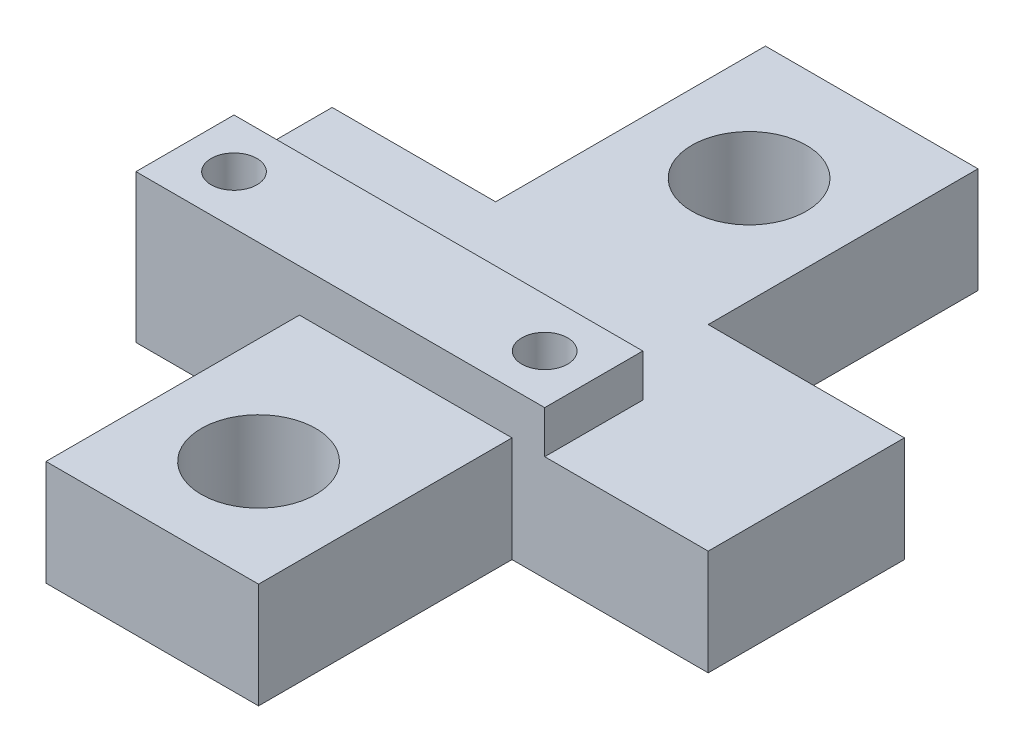
ISO-10303-21;
HEADER;
FILE_DESCRIPTION(('STEP AP214'),'2;1');
FILE_NAME('part.step','',(''),(''),'','','');
FILE_SCHEMA(('AUTOMOTIVE_DESIGN { 1 0 10303 214 1 1 1 1 }'));
ENDSEC;
DATA;
#1=APPLICATION_CONTEXT('core data for automotive mechanical design processes');
#2=APPLICATION_PROTOCOL_DEFINITION('international standard','automotive_design',2000,#1);
#3=PRODUCT_CONTEXT('',#1,'mechanical');
#4=PRODUCT('Part','Part','',(#3));
#5=PRODUCT_RELATED_PRODUCT_CATEGORY('part','',(#4));
#6=PRODUCT_DEFINITION_FORMATION('','',#4);
#7=PRODUCT_DEFINITION_CONTEXT('part definition',#1,'design');
#8=PRODUCT_DEFINITION('design','',#6,#7);
#9=PRODUCT_DEFINITION_SHAPE('','',#8);
#10=(LENGTH_UNIT() NAMED_UNIT(*) SI_UNIT(.MILLI.,.METRE.));
#11=(NAMED_UNIT(*) PLANE_ANGLE_UNIT() SI_UNIT($,.RADIAN.));
#12=(NAMED_UNIT(*) SI_UNIT($,.STERADIAN.) SOLID_ANGLE_UNIT());
#13=UNCERTAINTY_MEASURE_WITH_UNIT(LENGTH_MEASURE(1.E-05),#10,'distance_accuracy_value','');
#14=(GEOMETRIC_REPRESENTATION_CONTEXT(3) GLOBAL_UNCERTAINTY_ASSIGNED_CONTEXT((#13)) GLOBAL_UNIT_ASSIGNED_CONTEXT((#10,
#11,#12)) REPRESENTATION_CONTEXT('',''));
#15=CARTESIAN_POINT('',(0.,0.,0.));
#16=DIRECTION('',(0.,0.,1.));
#17=DIRECTION('',(1.,0.,0.));
#18=AXIS2_PLACEMENT_3D('',#15,#16,#17);
#19=CARTESIAN_POINT('',(0.,6.45,0.));
#20=DIRECTION('',(0.,1.,0.));
#21=DIRECTION('',(0.,0.,1.));
#22=AXIS2_PLACEMENT_3D('',#19,#20,#21);
#23=PLANE('',#22);
#24=CARTESIAN_POINT('',(-0.999999999999997,6.45,15.));
#25=DIRECTION('',(0.,1.,0.));
#26=DIRECTION('',(0.,0.,1.));
#27=AXIS2_PLACEMENT_3D('',#24,#25,#26);
#28=CIRCLE('',#27,3.5);
#29=CARTESIAN_POINT('',(-0.999999999999997,6.45,18.5));
#30=VERTEX_POINT('',#29);
#31=EDGE_CURVE('E340',#30,#30,#28,.T.);
#32=ORIENTED_EDGE('',*,*,#31,.F.);
#33=EDGE_LOOP('',(#32));
#34=FACE_BOUND('',#33,.T.);
#35=DIRECTION('',(1.,0.,0.));
#36=VECTOR('',#35,1.);
#37=CARTESIAN_POINT('',(-17.5,6.45,6.));
#38=LINE('',#37,#36);
#39=CARTESIAN_POINT('',(-7.5,6.45,6.));
#40=VERTEX_POINT('',#39);
#41=CARTESIAN_POINT('',(5.5,6.45,6.));
#42=VERTEX_POINT('',#41);
#43=EDGE_CURVE('E11',#40,#42,#38,.T.);
#44=ORIENTED_EDGE('',*,*,#43,.F.);
#45=DIRECTION('',(0.,0.,1.));
#46=VECTOR('',#45,1.);
#47=CARTESIAN_POINT('',(-7.5,6.45,21.5));
#48=LINE('',#47,#46);
#49=CARTESIAN_POINT('',(-7.5,6.45,21.5));
#50=VERTEX_POINT('',#49);
#51=EDGE_CURVE('E183',#40,#50,#48,.T.);
#52=ORIENTED_EDGE('',*,*,#51,.T.);
#53=DIRECTION('',(1.,0.,0.));
#54=VECTOR('',#53,1.);
#55=CARTESIAN_POINT('',(-7.5,6.45,21.5));
#56=LINE('',#55,#54);
#57=CARTESIAN_POINT('',(5.5,6.45,21.5));
#58=VERTEX_POINT('',#57);
#59=EDGE_CURVE('E185',#50,#58,#56,.T.);
#60=ORIENTED_EDGE('',*,*,#59,.T.);
#61=DIRECTION('',(0.,0.,-1.));
#62=VECTOR('',#61,1.);
#63=CARTESIAN_POINT('',(5.5,6.45,21.5));
#64=LINE('',#63,#62);
#65=EDGE_CURVE('E187',#58,#42,#64,.T.);
#66=ORIENTED_EDGE('',*,*,#65,.T.);
#67=EDGE_LOOP('',(#44,#52,#60,#66));
#68=FACE_BOUND('',#67,.T.);
#69=ADVANCED_FACE('F32',(#34,#68),#23,.T.);
#70=CARTESIAN_POINT('',(5.5,6.45,-6.00000000000003));
#71=DIRECTION('',(0.,0.,1.));
#72=DIRECTION('',(1.,0.,0.));
#73=AXIS2_PLACEMENT_3D('',#70,#71,#72);
#74=PLANE('',#73);
#75=DIRECTION('',(-1.,0.,0.));
#76=VECTOR('',#75,1.);
#77=CARTESIAN_POINT('',(5.5,0.,-6.00000000000003));
#78=LINE('',#77,#76);
#79=CARTESIAN_POINT('',(17.5,0.,-6.00000000000007));
#80=VERTEX_POINT('',#79);
#81=CARTESIAN_POINT('',(5.5,0.,-6.00000000000003));
#82=VERTEX_POINT('',#81);
#83=EDGE_CURVE('E160',#80,#82,#78,.T.);
#84=ORIENTED_EDGE('',*,*,#83,.T.);
#85=DIRECTION('',(0.,-1.,0.));
#86=VECTOR('',#85,1.);
#87=CARTESIAN_POINT('',(5.5,6.45,-6.00000000000003));
#88=LINE('',#87,#86);
#89=CARTESIAN_POINT('',(5.5,6.45,-6.00000000000003));
#90=VERTEX_POINT('',#89);
#91=EDGE_CURVE('E36',#90,#82,#88,.T.);
#92=ORIENTED_EDGE('',*,*,#91,.F.);
#93=DIRECTION('',(-1.,0.,0.));
#94=VECTOR('',#93,1.);
#95=CARTESIAN_POINT('',(5.5,6.45,-6.00000000000003));
#96=LINE('',#95,#94);
#97=CARTESIAN_POINT('',(17.5,6.45,-6.00000000000007));
#98=VERTEX_POINT('',#97);
#99=EDGE_CURVE('E169',#98,#90,#96,.T.);
#100=ORIENTED_EDGE('',*,*,#99,.F.);
#101=DIRECTION('',(0.,-1.,0.));
#102=VECTOR('',#101,1.);
#103=CARTESIAN_POINT('',(17.5,6.45,-6.00000000000007));
#104=LINE('',#103,#102);
#105=EDGE_CURVE('E192',#98,#80,#104,.T.);
#106=ORIENTED_EDGE('',*,*,#105,.T.);
#107=EDGE_LOOP('',(#84,#92,#100,#106));
#108=FACE_BOUND('',#107,.T.);
#109=ADVANCED_FACE('F34',(#108),#74,.F.);
#110=CARTESIAN_POINT('',(5.5,6.45,-6.00000000000003));
#111=DIRECTION('',(-1.,0.,0.));
#112=DIRECTION('',(0.,0.,1.));
#113=AXIS2_PLACEMENT_3D('',#110,#111,#112);
#114=PLANE('',#113);
#115=DIRECTION('',(0.,0.,-1.));
#116=VECTOR('',#115,1.);
#117=CARTESIAN_POINT('',(5.5,0.,-6.00000000000003));
#118=LINE('',#117,#116);
#119=CARTESIAN_POINT('',(5.5,0.,-22.5));
#120=VERTEX_POINT('',#119);
#121=EDGE_CURVE('E163',#82,#120,#118,.T.);
#122=ORIENTED_EDGE('',*,*,#121,.T.);
#123=DIRECTION('',(0.,-1.,0.));
#124=VECTOR('',#123,1.);
#125=CARTESIAN_POINT('',(5.5,6.45,-22.5));
#126=LINE('',#125,#124);
#127=CARTESIAN_POINT('',(5.5,6.45,-22.5));
#128=VERTEX_POINT('',#127);
#129=EDGE_CURVE('E242',#128,#120,#126,.T.);
#130=ORIENTED_EDGE('',*,*,#129,.F.);
#131=DIRECTION('',(0.,0.,-1.));
#132=VECTOR('',#131,1.);
#133=CARTESIAN_POINT('',(5.5,6.45,-6.00000000000003));
#134=LINE('',#133,#132);
#135=EDGE_CURVE('E172',#90,#128,#134,.T.);
#136=ORIENTED_EDGE('',*,*,#135,.F.);
#137=ORIENTED_EDGE('',*,*,#91,.T.);
#138=EDGE_LOOP('',(#122,#130,#136,#137));
#139=FACE_BOUND('',#138,.T.);
#140=ADVANCED_FACE('F251',(#139),#114,.F.);
#141=CARTESIAN_POINT('',(-7.5,6.45,-22.5));
#142=DIRECTION('',(0.,0.,1.));
#143=DIRECTION('',(1.,0.,0.));
#144=AXIS2_PLACEMENT_3D('',#141,#142,#143);
#145=PLANE('',#144);
#146=DIRECTION('',(-1.,0.,0.));
#147=VECTOR('',#146,1.);
#148=CARTESIAN_POINT('',(-7.5,0.,-22.5));
#149=LINE('',#148,#147);
#150=CARTESIAN_POINT('',(-7.5,0.,-22.5));
#151=VERTEX_POINT('',#150);
#152=EDGE_CURVE('E195',#120,#151,#149,.T.);
#153=ORIENTED_EDGE('',*,*,#152,.T.);
#154=DIRECTION('',(0.,-1.,0.));
#155=VECTOR('',#154,1.);
#156=CARTESIAN_POINT('',(-7.5,6.45,-22.5));
#157=LINE('',#156,#155);
#158=CARTESIAN_POINT('',(-7.5,6.45,-22.5));
#159=VERTEX_POINT('',#158);
#160=EDGE_CURVE('E240',#159,#151,#157,.T.);
#161=ORIENTED_EDGE('',*,*,#160,.F.);
#162=DIRECTION('',(-1.,0.,0.));
#163=VECTOR('',#162,1.);
#164=CARTESIAN_POINT('',(-7.5,6.45,-22.5));
#165=LINE('',#164,#163);
#166=EDGE_CURVE('E175',#128,#159,#165,.T.);
#167=ORIENTED_EDGE('',*,*,#166,.F.);
#168=ORIENTED_EDGE('',*,*,#129,.T.);
#169=EDGE_LOOP('',(#153,#161,#167,#168));
#170=FACE_BOUND('',#169,.T.);
#171=ADVANCED_FACE('F263',(#170),#145,.F.);
#172=CARTESIAN_POINT('',(-7.5,6.45,-6.));
#173=DIRECTION('',(1.,0.,0.));
#174=DIRECTION('',(0.,0.,-1.));
#175=AXIS2_PLACEMENT_3D('',#172,#173,#174);
#176=PLANE('',#175);
#177=DIRECTION('',(0.,0.,1.));
#178=VECTOR('',#177,1.);
#179=CARTESIAN_POINT('',(-7.5,0.,-6.));
#180=LINE('',#179,#178);
#181=CARTESIAN_POINT('',(-7.5,0.,-6.));
#182=VERTEX_POINT('',#181);
#183=EDGE_CURVE('E197',#151,#182,#180,.T.);
#184=ORIENTED_EDGE('',*,*,#183,.T.);
#185=DIRECTION('',(0.,-1.,0.));
#186=VECTOR('',#185,1.);
#187=CARTESIAN_POINT('',(-7.5,6.45,-6.));
#188=LINE('',#187,#186);
#189=CARTESIAN_POINT('',(-7.5,6.45,-6.));
#190=VERTEX_POINT('',#189);
#191=EDGE_CURVE('E237',#190,#182,#188,.T.);
#192=ORIENTED_EDGE('',*,*,#191,.F.);
#193=DIRECTION('',(0.,0.,1.));
#194=VECTOR('',#193,1.);
#195=CARTESIAN_POINT('',(-7.5,6.45,-6.));
#196=LINE('',#195,#194);
#197=EDGE_CURVE('E177',#159,#190,#196,.T.);
#198=ORIENTED_EDGE('',*,*,#197,.F.);
#199=ORIENTED_EDGE('',*,*,#160,.T.);
#200=EDGE_LOOP('',(#184,#192,#198,#199));
#201=FACE_BOUND('',#200,.T.);
#202=ADVANCED_FACE('F266',(#201),#176,.F.);
#203=CARTESIAN_POINT('',(-17.5,6.45,-6.));
#204=DIRECTION('',(0.,0.,1.));
#205=DIRECTION('',(1.,0.,0.));
#206=AXIS2_PLACEMENT_3D('',#203,#204,#205);
#207=PLANE('',#206);
#208=DIRECTION('',(-1.,0.,0.));
#209=VECTOR('',#208,1.);
#210=CARTESIAN_POINT('',(-17.5,0.,-6.));
#211=LINE('',#210,#209);
#212=CARTESIAN_POINT('',(-17.5,0.,-6.));
#213=VERTEX_POINT('',#212);
#214=EDGE_CURVE('E199',#182,#213,#211,.T.);
#215=ORIENTED_EDGE('',*,*,#214,.T.);
#216=DIRECTION('',(0.,-1.,0.));
#217=VECTOR('',#216,1.);
#218=CARTESIAN_POINT('',(-17.5,6.45,-6.));
#219=LINE('',#218,#217);
#220=CARTESIAN_POINT('',(-17.5,6.45,-6.));
#221=VERTEX_POINT('',#220);
#222=EDGE_CURVE('E234',#221,#213,#219,.T.);
#223=ORIENTED_EDGE('',*,*,#222,.F.);
#224=DIRECTION('',(-1.,0.,0.));
#225=VECTOR('',#224,1.);
#226=CARTESIAN_POINT('',(-17.5,6.45,-6.));
#227=LINE('',#226,#225);
#228=EDGE_CURVE('E179',#190,#221,#227,.T.);
#229=ORIENTED_EDGE('',*,*,#228,.F.);
#230=ORIENTED_EDGE('',*,*,#191,.T.);
#231=EDGE_LOOP('',(#215,#223,#229,#230));
#232=FACE_BOUND('',#231,.T.);
#233=ADVANCED_FACE('F304',(#232),#207,.F.);
#234=CARTESIAN_POINT('',(-17.5,6.45,6.));
#235=DIRECTION('',(1.,0.,0.));
#236=DIRECTION('',(0.,0.,-1.));
#237=AXIS2_PLACEMENT_3D('',#234,#235,#236);
#238=PLANE('',#237);
#239=DIRECTION('',(0.,0.,1.));
#240=VECTOR('',#239,1.);
#241=CARTESIAN_POINT('',(-17.5,0.,6.));
#242=LINE('',#241,#240);
#243=CARTESIAN_POINT('',(-17.5,0.,6.));
#244=VERTEX_POINT('',#243);
#245=EDGE_CURVE('E201',#213,#244,#242,.T.);
#246=ORIENTED_EDGE('',*,*,#245,.T.);
#247=DIRECTION('',(0.,-1.,0.));
#248=VECTOR('',#247,1.);
#249=CARTESIAN_POINT('',(-17.5,6.45,6.));
#250=LINE('',#249,#248);
#251=CARTESIAN_POINT('',(-17.5,9.05,6.));
#252=VERTEX_POINT('',#251);
#253=EDGE_CURVE('E231',#252,#244,#250,.T.);
#254=ORIENTED_EDGE('',*,*,#253,.F.);
#255=DIRECTION('',(0.,0.,1.));
#256=VECTOR('',#255,1.);
#257=CARTESIAN_POINT('',(-17.5,9.05,0.));
#258=LINE('',#257,#256);
#259=CARTESIAN_POINT('',(-17.5,9.05,0.));
#260=VERTEX_POINT('',#259);
#261=EDGE_CURVE('E148',#260,#252,#258,.T.);
#262=ORIENTED_EDGE('',*,*,#261,.F.);
#263=DIRECTION('',(0.,-1.,0.));
#264=VECTOR('',#263,1.);
#265=CARTESIAN_POINT('',(-17.5,9.05,0.));
#266=LINE('',#265,#264);
#267=CARTESIAN_POINT('',(-17.5,6.45,0.));
#268=VERTEX_POINT('',#267);
#269=EDGE_CURVE('E144',#260,#268,#266,.T.);
#270=ORIENTED_EDGE('',*,*,#269,.T.);
#271=DIRECTION('',(0.,0.,1.));
#272=VECTOR('',#271,1.);
#273=CARTESIAN_POINT('',(-17.5,6.45,6.));
#274=LINE('',#273,#272);
#275=EDGE_CURVE('E181',#221,#268,#274,.T.);
#276=ORIENTED_EDGE('',*,*,#275,.F.);
#277=ORIENTED_EDGE('',*,*,#222,.T.);
#278=EDGE_LOOP('',(#246,#254,#262,#270,#276,#277));
#279=FACE_BOUND('',#278,.T.);
#280=ADVANCED_FACE('F296',(#279),#238,.F.);
#281=CARTESIAN_POINT('',(-7.5,6.45,21.5));
#282=DIRECTION('',(1.,0.,0.));
#283=DIRECTION('',(0.,0.,-1.));
#284=AXIS2_PLACEMENT_3D('',#281,#282,#283);
#285=PLANE('',#284);
#286=DIRECTION('',(0.,0.,1.));
#287=VECTOR('',#286,1.);
#288=CARTESIAN_POINT('',(-7.5,0.,21.5));
#289=LINE('',#288,#287);
#290=CARTESIAN_POINT('',(-7.5,0.,6.));
#291=VERTEX_POINT('',#290);
#292=CARTESIAN_POINT('',(-7.5,0.,21.5));
#293=VERTEX_POINT('',#292);
#294=EDGE_CURVE('E205',#291,#293,#289,.T.);
#295=ORIENTED_EDGE('',*,*,#294,.T.);
#296=DIRECTION('',(0.,-1.,0.));
#297=VECTOR('',#296,1.);
#298=CARTESIAN_POINT('',(-7.5,6.45,21.5));
#299=LINE('',#298,#297);
#300=EDGE_CURVE('E225',#50,#293,#299,.T.);
#301=ORIENTED_EDGE('',*,*,#300,.F.);
#302=ORIENTED_EDGE('',*,*,#51,.F.);
#303=DIRECTION('',(0.,-1.,0.));
#304=VECTOR('',#303,1.);
#305=CARTESIAN_POINT('',(-7.5,6.45,6.));
#306=LINE('',#305,#304);
#307=EDGE_CURVE('E228',#40,#291,#306,.T.);
#308=ORIENTED_EDGE('',*,*,#307,.T.);
#309=EDGE_LOOP('',(#295,#301,#302,#308));
#310=FACE_BOUND('',#309,.T.);
#311=ADVANCED_FACE('F291',(#310),#285,.F.);
#312=CARTESIAN_POINT('',(-7.5,6.45,21.5));
#313=DIRECTION('',(0.,0.,-1.));
#314=DIRECTION('',(-1.,0.,0.));
#315=AXIS2_PLACEMENT_3D('',#312,#313,#314);
#316=PLANE('',#315);
#317=DIRECTION('',(1.,0.,0.));
#318=VECTOR('',#317,1.);
#319=CARTESIAN_POINT('',(-7.5,0.,21.5));
#320=LINE('',#319,#318);
#321=CARTESIAN_POINT('',(5.5,0.,21.5));
#322=VERTEX_POINT('',#321);
#323=EDGE_CURVE('E207',#293,#322,#320,.T.);
#324=ORIENTED_EDGE('',*,*,#323,.T.);
#325=DIRECTION('',(0.,-1.,0.));
#326=VECTOR('',#325,1.);
#327=CARTESIAN_POINT('',(5.5,6.45,21.5));
#328=LINE('',#327,#326);
#329=EDGE_CURVE('E222',#58,#322,#328,.T.);
#330=ORIENTED_EDGE('',*,*,#329,.F.);
#331=ORIENTED_EDGE('',*,*,#59,.F.);
#332=ORIENTED_EDGE('',*,*,#300,.T.);
#333=EDGE_LOOP('',(#324,#330,#331,#332));
#334=FACE_BOUND('',#333,.T.);
#335=ADVANCED_FACE('F287',(#334),#316,.F.);
#336=CARTESIAN_POINT('',(5.5,6.45,21.5));
#337=DIRECTION('',(-1.,0.,0.));
#338=DIRECTION('',(0.,0.,1.));
#339=AXIS2_PLACEMENT_3D('',#336,#337,#338);
#340=PLANE('',#339);
#341=DIRECTION('',(0.,0.,-1.));
#342=VECTOR('',#341,1.);
#343=CARTESIAN_POINT('',(5.5,0.,21.5));
#344=LINE('',#343,#342);
#345=CARTESIAN_POINT('',(5.5,0.,6.));
#346=VERTEX_POINT('',#345);
#347=EDGE_CURVE('E209',#322,#346,#344,.T.);
#348=ORIENTED_EDGE('',*,*,#347,.T.);
#349=DIRECTION('',(0.,-1.,0.));
#350=VECTOR('',#349,1.);
#351=CARTESIAN_POINT('',(5.5,6.45,6.));
#352=LINE('',#351,#350);
#353=EDGE_CURVE('E219',#42,#346,#352,.T.);
#354=ORIENTED_EDGE('',*,*,#353,.F.);
#355=ORIENTED_EDGE('',*,*,#65,.F.);
#356=ORIENTED_EDGE('',*,*,#329,.T.);
#357=EDGE_LOOP('',(#348,#354,#355,#356));
#358=FACE_BOUND('',#357,.T.);
#359=ADVANCED_FACE('F282',(#358),#340,.F.);
#360=CARTESIAN_POINT('',(5.5,6.45,6.));
#361=DIRECTION('',(0.,0.,-1.));
#362=DIRECTION('',(-1.,0.,0.));
#363=AXIS2_PLACEMENT_3D('',#360,#361,#362);
#364=PLANE('',#363);
#365=DIRECTION('',(1.,0.,0.));
#366=VECTOR('',#365,1.);
#367=CARTESIAN_POINT('',(5.5,0.,6.));
#368=LINE('',#367,#366);
#369=CARTESIAN_POINT('',(17.5,0.,6.));
#370=VERTEX_POINT('',#369);
#371=EDGE_CURVE('E211',#346,#370,#368,.T.);
#372=ORIENTED_EDGE('',*,*,#371,.T.);
#373=DIRECTION('',(0.,-1.,0.));
#374=VECTOR('',#373,1.);
#375=CARTESIAN_POINT('',(17.5,6.45,6.));
#376=LINE('',#375,#374);
#377=CARTESIAN_POINT('',(17.5,6.45,6.));
#378=VERTEX_POINT('',#377);
#379=EDGE_CURVE('E216',#378,#370,#376,.T.);
#380=ORIENTED_EDGE('',*,*,#379,.F.);
#381=DIRECTION('',(1.,0.,0.));
#382=VECTOR('',#381,1.);
#383=CARTESIAN_POINT('',(5.5,6.45,6.));
#384=LINE('',#383,#382);
#385=CARTESIAN_POINT('',(7.5,6.45,6.));
#386=VERTEX_POINT('',#385);
#387=EDGE_CURVE('E189',#386,#378,#384,.T.);
#388=ORIENTED_EDGE('',*,*,#387,.F.);
#389=DIRECTION('',(0.,-1.,0.));
#390=VECTOR('',#389,1.);
#391=CARTESIAN_POINT('',(7.5,9.05,6.));
#392=LINE('',#391,#390);
#393=CARTESIAN_POINT('',(7.5,9.05,6.));
#394=VERTEX_POINT('',#393);
#395=EDGE_CURVE('E165',#394,#386,#392,.T.);
#396=ORIENTED_EDGE('',*,*,#395,.F.);
#397=DIRECTION('',(1.,0.,0.));
#398=VECTOR('',#397,1.);
#399=CARTESIAN_POINT('',(-17.5,9.05,6.));
#400=LINE('',#399,#398);
#401=EDGE_CURVE('E154',#252,#394,#400,.T.);
#402=ORIENTED_EDGE('',*,*,#401,.F.);
#403=ORIENTED_EDGE('',*,*,#253,.T.);
#404=DIRECTION('',(1.,0.,0.));
#405=VECTOR('',#404,1.);
#406=CARTESIAN_POINT('',(-17.5,0.,6.));
#407=LINE('',#406,#405);
#408=EDGE_CURVE('E203',#244,#291,#407,.T.);
#409=ORIENTED_EDGE('',*,*,#408,.T.);
#410=ORIENTED_EDGE('',*,*,#307,.F.);
#411=ORIENTED_EDGE('',*,*,#43,.T.);
#412=ORIENTED_EDGE('',*,*,#353,.T.);
#413=EDGE_LOOP('',(#372,#380,#388,#396,#402,#403,#409,#410,#411,#412));
#414=FACE_BOUND('',#413,.T.);
#415=ADVANCED_FACE('F276',(#414),#364,.F.);
#416=CARTESIAN_POINT('',(17.5,6.45,6.));
#417=DIRECTION('',(-1.,0.,0.));
#418=DIRECTION('',(0.,0.,1.));
#419=AXIS2_PLACEMENT_3D('',#416,#417,#418);
#420=PLANE('',#419);
#421=DIRECTION('',(0.,0.,-1.));
#422=VECTOR('',#421,1.);
#423=CARTESIAN_POINT('',(17.5,0.,6.));
#424=LINE('',#423,#422);
#425=EDGE_CURVE('E173',#370,#80,#424,.T.);
#426=ORIENTED_EDGE('',*,*,#425,.T.);
#427=ORIENTED_EDGE('',*,*,#105,.F.);
#428=DIRECTION('',(0.,0.,-1.));
#429=VECTOR('',#428,1.);
#430=CARTESIAN_POINT('',(17.5,6.45,6.));
#431=LINE('',#430,#429);
#432=EDGE_CURVE('E191',#378,#98,#431,.T.);
#433=ORIENTED_EDGE('',*,*,#432,.F.);
#434=ORIENTED_EDGE('',*,*,#379,.T.);
#435=EDGE_LOOP('',(#426,#427,#433,#434));
#436=FACE_BOUND('',#435,.T.);
#437=ADVANCED_FACE('F274',(#436),#420,.F.);
#438=CARTESIAN_POINT('',(-1.,6.45,-15.));
#439=DIRECTION('',(0.,1.,0.));
#440=DIRECTION('',(0.,0.,1.));
#441=AXIS2_PLACEMENT_3D('',#438,#439,#440);
#442=CIRCLE('',#441,3.5);
#443=CARTESIAN_POINT('',(-1.,6.45,-11.5));
#444=VERTEX_POINT('',#443);
#445=EDGE_CURVE('E333',#444,#444,#442,.T.);
#446=ORIENTED_EDGE('',*,*,#445,.F.);
#447=EDGE_LOOP('',(#446));
#448=FACE_BOUND('',#447,.T.);
#449=DIRECTION('',(0.,0.,-1.));
#450=VECTOR('',#449,1.);
#451=CARTESIAN_POINT('',(7.5,6.45,0.));
#452=LINE('',#451,#450);
#453=CARTESIAN_POINT('',(7.5,6.45,0.));
#454=VERTEX_POINT('',#453);
#455=EDGE_CURVE('E53',#386,#454,#452,.T.);
#456=ORIENTED_EDGE('',*,*,#455,.F.);
#457=ORIENTED_EDGE('',*,*,#387,.T.);
#458=ORIENTED_EDGE('',*,*,#432,.T.);
#459=ORIENTED_EDGE('',*,*,#99,.T.);
#460=ORIENTED_EDGE('',*,*,#135,.T.);
#461=ORIENTED_EDGE('',*,*,#166,.T.);
#462=ORIENTED_EDGE('',*,*,#197,.T.);
#463=ORIENTED_EDGE('',*,*,#228,.T.);
#464=ORIENTED_EDGE('',*,*,#275,.T.);
#465=DIRECTION('',(-1.,0.,0.));
#466=VECTOR('',#465,1.);
#467=CARTESIAN_POINT('',(-17.5,6.45,0.));
#468=LINE('',#467,#466);
#469=EDGE_CURVE('E48',#454,#268,#468,.T.);
#470=ORIENTED_EDGE('',*,*,#469,.F.);
#471=EDGE_LOOP('',(#456,#457,#458,#459,#460,#461,#462,#463,#464,#470));
#472=FACE_BOUND('',#471,.T.);
#473=ADVANCED_FACE('F269',(#448,#472),#23,.T.);
#474=CARTESIAN_POINT('',(0.,0.,0.));
#475=DIRECTION('',(0.,1.,0.));
#476=DIRECTION('',(0.,0.,1.));
#477=AXIS2_PLACEMENT_3D('',#474,#475,#476);
#478=PLANE('',#477);
#479=CARTESIAN_POINT('',(4.5,0.,3.));
#480=DIRECTION('',(0.,1.,0.));
#481=DIRECTION('',(0.,0.,1.));
#482=AXIS2_PLACEMENT_3D('',#479,#480,#481);
#483=CIRCLE('',#482,1.4);
#484=CARTESIAN_POINT('',(4.5,0.,4.4));
#485=VERTEX_POINT('',#484);
#486=EDGE_CURVE('E349',#485,#485,#483,.T.);
#487=ORIENTED_EDGE('',*,*,#486,.T.);
#488=EDGE_LOOP('',(#487));
#489=FACE_BOUND('',#488,.T.);
#490=CARTESIAN_POINT('',(-14.5,0.,3.));
#491=DIRECTION('',(0.,1.,0.));
#492=DIRECTION('',(0.,0.,1.));
#493=AXIS2_PLACEMENT_3D('',#490,#491,#492);
#494=CIRCLE('',#493,1.4);
#495=CARTESIAN_POINT('',(-14.5,0.,4.4));
#496=VERTEX_POINT('',#495);
#497=EDGE_CURVE('E344',#496,#496,#494,.T.);
#498=ORIENTED_EDGE('',*,*,#497,.T.);
#499=EDGE_LOOP('',(#498));
#500=FACE_BOUND('',#499,.T.);
#501=CARTESIAN_POINT('',(-0.999999999999997,0.,15.));
#502=DIRECTION('',(0.,1.,0.));
#503=DIRECTION('',(0.,0.,1.));
#504=AXIS2_PLACEMENT_3D('',#501,#502,#503);
#505=CIRCLE('',#504,3.5);
#506=CARTESIAN_POINT('',(-0.999999999999997,0.,18.5));
#507=VERTEX_POINT('',#506);
#508=EDGE_CURVE('E335',#507,#507,#505,.T.);
#509=ORIENTED_EDGE('',*,*,#508,.T.);
#510=EDGE_LOOP('',(#509));
#511=FACE_BOUND('',#510,.T.);
#512=CARTESIAN_POINT('',(-1.,0.,-15.));
#513=DIRECTION('',(0.,1.,0.));
#514=DIRECTION('',(0.,0.,1.));
#515=AXIS2_PLACEMENT_3D('',#512,#513,#514);
#516=CIRCLE('',#515,3.5);
#517=CARTESIAN_POINT('',(-1.,0.,-11.5));
#518=VERTEX_POINT('',#517);
#519=EDGE_CURVE('E301',#518,#518,#516,.T.);
#520=ORIENTED_EDGE('',*,*,#519,.T.);
#521=EDGE_LOOP('',(#520));
#522=FACE_BOUND('',#521,.T.);
#523=ORIENTED_EDGE('',*,*,#83,.F.);
#524=ORIENTED_EDGE('',*,*,#425,.F.);
#525=ORIENTED_EDGE('',*,*,#371,.F.);
#526=ORIENTED_EDGE('',*,*,#347,.F.);
#527=ORIENTED_EDGE('',*,*,#323,.F.);
#528=ORIENTED_EDGE('',*,*,#294,.F.);
#529=ORIENTED_EDGE('',*,*,#408,.F.);
#530=ORIENTED_EDGE('',*,*,#245,.F.);
#531=ORIENTED_EDGE('',*,*,#214,.F.);
#532=ORIENTED_EDGE('',*,*,#183,.F.);
#533=ORIENTED_EDGE('',*,*,#152,.F.);
#534=ORIENTED_EDGE('',*,*,#121,.F.);
#535=EDGE_LOOP('',(#523,#524,#525,#526,#527,#528,#529,#530,#531,#532,#533,#534));
#536=FACE_BOUND('',#535,.T.);
#537=ADVANCED_FACE('F258',(#489,#500,#511,#522,#536),#478,.F.);
#538=CARTESIAN_POINT('',(7.5,9.05,0.));
#539=DIRECTION('',(-1.,0.,0.));
#540=DIRECTION('',(0.,0.,1.));
#541=AXIS2_PLACEMENT_3D('',#538,#539,#540);
#542=PLANE('',#541);
#543=ORIENTED_EDGE('',*,*,#455,.T.);
#544=DIRECTION('',(0.,-1.,0.));
#545=VECTOR('',#544,1.);
#546=CARTESIAN_POINT('',(7.5,9.05,0.));
#547=LINE('',#546,#545);
#548=CARTESIAN_POINT('',(7.5,9.05,0.));
#549=VERTEX_POINT('',#548);
#550=EDGE_CURVE('E142',#549,#454,#547,.T.);
#551=ORIENTED_EDGE('',*,*,#550,.F.);
#552=DIRECTION('',(0.,0.,-1.));
#553=VECTOR('',#552,1.);
#554=CARTESIAN_POINT('',(7.5,9.05,0.));
#555=LINE('',#554,#553);
#556=EDGE_CURVE('E149',#394,#549,#555,.T.);
#557=ORIENTED_EDGE('',*,*,#556,.F.);
#558=ORIENTED_EDGE('',*,*,#395,.T.);
#559=EDGE_LOOP('',(#543,#551,#557,#558));
#560=FACE_BOUND('',#559,.T.);
#561=ADVANCED_FACE('F159',(#560),#542,.F.);
#562=CARTESIAN_POINT('',(-17.5,9.05,0.));
#563=DIRECTION('',(0.,0.,1.));
#564=DIRECTION('',(1.,0.,0.));
#565=AXIS2_PLACEMENT_3D('',#562,#563,#564);
#566=PLANE('',#565);
#567=ORIENTED_EDGE('',*,*,#469,.T.);
#568=ORIENTED_EDGE('',*,*,#269,.F.);
#569=DIRECTION('',(-1.,0.,0.));
#570=VECTOR('',#569,1.);
#571=CARTESIAN_POINT('',(-17.5,9.05,0.));
#572=LINE('',#571,#570);
#573=EDGE_CURVE('E138',#549,#260,#572,.T.);
#574=ORIENTED_EDGE('',*,*,#573,.F.);
#575=ORIENTED_EDGE('',*,*,#550,.T.);
#576=EDGE_LOOP('',(#567,#568,#574,#575));
#577=FACE_BOUND('',#576,.T.);
#578=ADVANCED_FACE('F140',(#577),#566,.F.);
#579=CARTESIAN_POINT('',(0.,9.05,0.));
#580=DIRECTION('',(0.,1.,0.));
#581=DIRECTION('',(0.,0.,1.));
#582=AXIS2_PLACEMENT_3D('',#579,#580,#581);
#583=PLANE('',#582);
#584=CARTESIAN_POINT('',(4.5,9.05,3.));
#585=DIRECTION('',(0.,1.,0.));
#586=DIRECTION('',(0.,0.,1.));
#587=AXIS2_PLACEMENT_3D('',#584,#585,#586);
#588=CIRCLE('',#587,1.4);
#589=CARTESIAN_POINT('',(4.5,9.05,4.4));
#590=VERTEX_POINT('',#589);
#591=EDGE_CURVE('E352',#590,#590,#588,.T.);
#592=ORIENTED_EDGE('',*,*,#591,.F.);
#593=EDGE_LOOP('',(#592));
#594=FACE_BOUND('',#593,.T.);
#595=CARTESIAN_POINT('',(-14.5,9.05,3.));
#596=DIRECTION('',(0.,1.,0.));
#597=DIRECTION('',(0.,0.,1.));
#598=AXIS2_PLACEMENT_3D('',#595,#596,#597);
#599=CIRCLE('',#598,1.4);
#600=CARTESIAN_POINT('',(-14.5,9.05,4.4));
#601=VERTEX_POINT('',#600);
#602=EDGE_CURVE('E346',#601,#601,#599,.T.);
#603=ORIENTED_EDGE('',*,*,#602,.F.);
#604=EDGE_LOOP('',(#603));
#605=FACE_BOUND('',#604,.T.);
#606=ORIENTED_EDGE('',*,*,#556,.T.);
#607=ORIENTED_EDGE('',*,*,#573,.T.);
#608=ORIENTED_EDGE('',*,*,#261,.T.);
#609=ORIENTED_EDGE('',*,*,#401,.T.);
#610=EDGE_LOOP('',(#606,#607,#608,#609));
#611=FACE_BOUND('',#610,.T.);
#612=ADVANCED_FACE('F152',(#594,#605,#611),#583,.T.);
#613=CARTESIAN_POINT('',(-1.,0.,-15.));
#614=DIRECTION('',(0.,1.,0.));
#615=DIRECTION('',(0.,0.,1.));
#616=AXIS2_PLACEMENT_3D('',#613,#614,#615);
#617=CYLINDRICAL_SURFACE('',#616,3.5);
#618=ORIENTED_EDGE('',*,*,#519,.F.);
#619=EDGE_LOOP('',(#618));
#620=FACE_BOUND('',#619,.T.);
#621=ORIENTED_EDGE('',*,*,#445,.T.);
#622=EDGE_LOOP('',(#621));
#623=FACE_BOUND('',#622,.T.);
#624=ADVANCED_FACE('F368',(#620,#623),#617,.F.);
#625=CARTESIAN_POINT('',(-0.999999999999997,0.,15.));
#626=DIRECTION('',(0.,1.,0.));
#627=DIRECTION('',(0.,0.,1.));
#628=AXIS2_PLACEMENT_3D('',#625,#626,#627);
#629=CYLINDRICAL_SURFACE('',#628,3.5);
#630=ORIENTED_EDGE('',*,*,#508,.F.);
#631=EDGE_LOOP('',(#630));
#632=FACE_BOUND('',#631,.T.);
#633=ORIENTED_EDGE('',*,*,#31,.T.);
#634=EDGE_LOOP('',(#633));
#635=FACE_BOUND('',#634,.T.);
#636=ADVANCED_FACE('F373',(#632,#635),#629,.F.);
#637=CARTESIAN_POINT('',(-14.5,0.,3.));
#638=DIRECTION('',(0.,1.,0.));
#639=DIRECTION('',(0.,0.,1.));
#640=AXIS2_PLACEMENT_3D('',#637,#638,#639);
#641=CYLINDRICAL_SURFACE('',#640,1.4);
#642=ORIENTED_EDGE('',*,*,#497,.F.);
#643=EDGE_LOOP('',(#642));
#644=FACE_BOUND('',#643,.T.);
#645=ORIENTED_EDGE('',*,*,#602,.T.);
#646=EDGE_LOOP('',(#645));
#647=FACE_BOUND('',#646,.T.);
#648=ADVANCED_FACE('F362',(#644,#647),#641,.F.);
#649=CARTESIAN_POINT('',(4.5,0.,3.));
#650=DIRECTION('',(0.,1.,0.));
#651=DIRECTION('',(0.,0.,1.));
#652=AXIS2_PLACEMENT_3D('',#649,#650,#651);
#653=CYLINDRICAL_SURFACE('',#652,1.4);
#654=ORIENTED_EDGE('',*,*,#486,.F.);
#655=EDGE_LOOP('',(#654));
#656=FACE_BOUND('',#655,.T.);
#657=ORIENTED_EDGE('',*,*,#591,.T.);
#658=EDGE_LOOP('',(#657));
#659=FACE_BOUND('',#658,.T.);
#660=ADVANCED_FACE('F359',(#656,#659),#653,.F.);
#661=CLOSED_SHELL('',(#69,#109,#140,#171,#202,#233,#280,#311,#335,#359,#415,#437,#473,#537,#561,
#578,#612,#624,#636,#648,#660));
#662=MANIFOLD_SOLID_BREP('B2',#661);
#663=ADVANCED_BREP_SHAPE_REPRESENTATION('',(#18,#662),#14);
#664=SHAPE_DEFINITION_REPRESENTATION(#9,#663);
ENDSEC;
END-ISO-10303-21;
